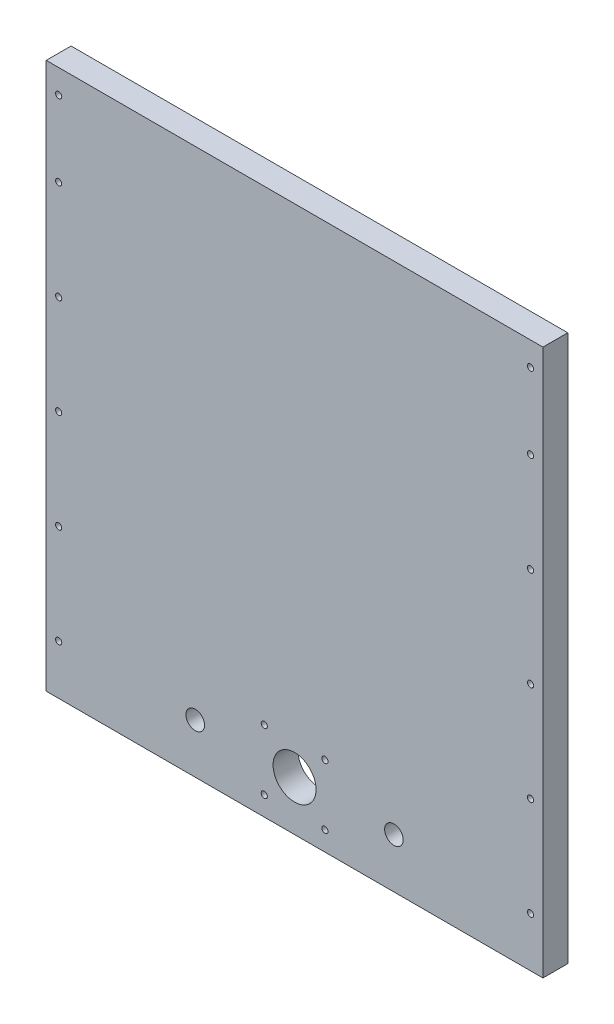
ISO-10303-21;
HEADER;
FILE_DESCRIPTION(('STEP AP214'),'2;1');
FILE_NAME('part.step','',(''),(''),'','','');
FILE_SCHEMA(('AUTOMOTIVE_DESIGN { 1 0 10303 214 1 1 1 1 }'));
ENDSEC;
DATA;
#1=APPLICATION_CONTEXT('core data for automotive mechanical design processes');
#2=APPLICATION_PROTOCOL_DEFINITION('international standard','automotive_design',2000,#1);
#3=PRODUCT_CONTEXT('',#1,'mechanical');
#4=PRODUCT('Part','Part','',(#3));
#5=PRODUCT_RELATED_PRODUCT_CATEGORY('part','',(#4));
#6=PRODUCT_DEFINITION_FORMATION('','',#4);
#7=PRODUCT_DEFINITION_CONTEXT('part definition',#1,'design');
#8=PRODUCT_DEFINITION('design','',#6,#7);
#9=PRODUCT_DEFINITION_SHAPE('','',#8);
#10=(LENGTH_UNIT() NAMED_UNIT(*) SI_UNIT(.MILLI.,.METRE.));
#11=(NAMED_UNIT(*) PLANE_ANGLE_UNIT() SI_UNIT($,.RADIAN.));
#12=(NAMED_UNIT(*) SI_UNIT($,.STERADIAN.) SOLID_ANGLE_UNIT());
#13=UNCERTAINTY_MEASURE_WITH_UNIT(LENGTH_MEASURE(1.E-05),#10,'distance_accuracy_value','');
#14=(GEOMETRIC_REPRESENTATION_CONTEXT(3) GLOBAL_UNCERTAINTY_ASSIGNED_CONTEXT((#13)) GLOBAL_UNIT_ASSIGNED_CONTEXT((#10,
#11,#12)) REPRESENTATION_CONTEXT('',''));
#15=CARTESIAN_POINT('',(0.,0.,0.));
#16=DIRECTION('',(0.,0.,1.));
#17=DIRECTION('',(1.,0.,0.));
#18=AXIS2_PLACEMENT_3D('',#15,#16,#17);
#19=CARTESIAN_POINT('',(0.,279.4,12.7));
#20=DIRECTION('',(0.,0.,-1.));
#21=DIRECTION('',(-1.,0.,0.));
#22=AXIS2_PLACEMENT_3D('',#19,#20,#21);
#23=PLANE('',#22);
#24=CARTESIAN_POINT('',(6.34999999999987,267.208,12.7));
#25=DIRECTION('',(0.,0.,1.));
#26=DIRECTION('',(1.,0.,0.));
#27=AXIS2_PLACEMENT_3D('',#24,#25,#26);
#28=CIRCLE('',#27,1.5875);
#29=CARTESIAN_POINT('',(7.93749999999986,267.208,12.7));
#30=VERTEX_POINT('',#29);
#31=EDGE_CURVE('E209',#30,#30,#28,.T.);
#32=ORIENTED_EDGE('',*,*,#31,.F.);
#33=EDGE_LOOP('',(#32));
#34=FACE_BOUND('',#33,.T.);
#35=CARTESIAN_POINT('',(111.511999988,9.91199998799979,12.7));
#36=DIRECTION('',(0.,0.,1.));
#37=DIRECTION('',(1.,0.,0.));
#38=AXIS2_PLACEMENT_3D('',#35,#36,#37);
#39=CIRCLE('',#38,1.58749999999999);
#40=CARTESIAN_POINT('',(113.099499988,9.91199998799979,12.7));
#41=VERTEX_POINT('',#40);
#42=EDGE_CURVE('E197',#41,#41,#39,.T.);
#43=ORIENTED_EDGE('',*,*,#42,.F.);
#44=EDGE_LOOP('',(#43));
#45=FACE_BOUND('',#44,.T.);
#46=CARTESIAN_POINT('',(111.511999988,40.8999999879998,12.7));
#47=DIRECTION('',(0.,0.,1.));
#48=DIRECTION('',(1.,0.,0.));
#49=AXIS2_PLACEMENT_3D('',#46,#47,#48);
#50=CIRCLE('',#49,1.58749999999999);
#51=CARTESIAN_POINT('',(113.099499988,40.8999999879998,12.7));
#52=VERTEX_POINT('',#51);
#53=EDGE_CURVE('E185',#52,#52,#50,.T.);
#54=ORIENTED_EDGE('',*,*,#53,.F.);
#55=EDGE_LOOP('',(#54));
#56=FACE_BOUND('',#55,.T.);
#57=CARTESIAN_POINT('',(142.499999988,40.899999988,12.7));
#58=DIRECTION('',(0.,0.,1.));
#59=DIRECTION('',(1.,0.,0.));
#60=AXIS2_PLACEMENT_3D('',#57,#58,#59);
#61=CIRCLE('',#60,1.58749999999999);
#62=CARTESIAN_POINT('',(144.087499988,40.899999988,12.7));
#63=VERTEX_POINT('',#62);
#64=EDGE_CURVE('E173',#63,#63,#61,.T.);
#65=ORIENTED_EDGE('',*,*,#64,.F.);
#66=EDGE_LOOP('',(#65));
#67=FACE_BOUND('',#66,.T.);
#68=CARTESIAN_POINT('',(177.8,25.4,12.7));
#69=DIRECTION('',(0.,0.,1.));
#70=DIRECTION('',(1.,0.,0.));
#71=AXIS2_PLACEMENT_3D('',#68,#69,#70);
#72=CIRCLE('',#71,4.76250000000001);
#73=CARTESIAN_POINT('',(182.5625,25.4,12.7));
#74=VERTEX_POINT('',#73);
#75=EDGE_CURVE('E161',#74,#74,#72,.T.);
#76=ORIENTED_EDGE('',*,*,#75,.F.);
#77=EDGE_LOOP('',(#76));
#78=FACE_BOUND('',#77,.T.);
#79=CARTESIAN_POINT('',(6.34999999999947,177.8,12.7));
#80=DIRECTION('',(0.,0.,1.));
#81=DIRECTION('',(1.,0.,0.));
#82=AXIS2_PLACEMENT_3D('',#79,#80,#81);
#83=CIRCLE('',#82,1.5875);
#84=CARTESIAN_POINT('',(7.93749999999947,177.8,12.7));
#85=VERTEX_POINT('',#84);
#86=EDGE_CURVE('E149',#85,#85,#83,.T.);
#87=ORIENTED_EDGE('',*,*,#86,.F.);
#88=EDGE_LOOP('',(#87));
#89=FACE_BOUND('',#88,.T.);
#90=CARTESIAN_POINT('',(6.34999999999965,127.,12.7));
#91=DIRECTION('',(0.,0.,1.));
#92=DIRECTION('',(1.,0.,0.));
#93=AXIS2_PLACEMENT_3D('',#90,#91,#92);
#94=CIRCLE('',#93,1.5875);
#95=CARTESIAN_POINT('',(7.93749999999964,127.,12.7));
#96=VERTEX_POINT('',#95);
#97=EDGE_CURVE('E137',#96,#96,#94,.T.);
#98=ORIENTED_EDGE('',*,*,#97,.F.);
#99=EDGE_LOOP('',(#98));
#100=FACE_BOUND('',#99,.T.);
#101=CARTESIAN_POINT('',(6.34999999999982,76.2,12.7));
#102=DIRECTION('',(0.,0.,1.));
#103=DIRECTION('',(1.,0.,0.));
#104=AXIS2_PLACEMENT_3D('',#101,#102,#103);
#105=CIRCLE('',#104,1.5875);
#106=CARTESIAN_POINT('',(7.93749999999982,76.2,12.7));
#107=VERTEX_POINT('',#106);
#108=EDGE_CURVE('E125',#107,#107,#105,.T.);
#109=ORIENTED_EDGE('',*,*,#108,.F.);
#110=EDGE_LOOP('',(#109));
#111=FACE_BOUND('',#110,.T.);
#112=CARTESIAN_POINT('',(76.2,25.4,12.7));
#113=DIRECTION('',(0.,0.,1.));
#114=DIRECTION('',(1.,0.,0.));
#115=AXIS2_PLACEMENT_3D('',#112,#113,#114);
#116=CIRCLE('',#115,4.7625);
#117=CARTESIAN_POINT('',(80.9625,25.4,12.7));
#118=VERTEX_POINT('',#117);
#119=EDGE_CURVE('E113',#118,#118,#116,.T.);
#120=ORIENTED_EDGE('',*,*,#119,.F.);
#121=EDGE_LOOP('',(#120));
#122=FACE_BOUND('',#121,.T.);
#123=DIRECTION('',(0.,-1.,0.));
#124=VECTOR('',#123,1.);
#125=CARTESIAN_POINT('',(0.,0.,12.7));
#126=LINE('',#125,#124);
#127=CARTESIAN_POINT('',(0.,279.4,12.7));
#128=VERTEX_POINT('',#127);
#129=CARTESIAN_POINT('',(0.,0.,12.7));
#130=VERTEX_POINT('',#129);
#131=EDGE_CURVE('E83',#128,#130,#126,.T.);
#132=ORIENTED_EDGE('',*,*,#131,.T.);
#133=DIRECTION('',(1.,0.,0.));
#134=VECTOR('',#133,1.);
#135=CARTESIAN_POINT('',(0.,0.,12.7));
#136=LINE('',#135,#134);
#137=CARTESIAN_POINT('',(254.,0.,12.7));
#138=VERTEX_POINT('',#137);
#139=EDGE_CURVE('E78',#130,#138,#136,.T.);
#140=ORIENTED_EDGE('',*,*,#139,.T.);
#141=DIRECTION('',(0.,1.,0.));
#142=VECTOR('',#141,1.);
#143=CARTESIAN_POINT('',(254.,0.,12.7));
#144=LINE('',#143,#142);
#145=CARTESIAN_POINT('',(254.,279.4,12.7));
#146=VERTEX_POINT('',#145);
#147=EDGE_CURVE('E81',#138,#146,#144,.T.);
#148=ORIENTED_EDGE('',*,*,#147,.T.);
#149=DIRECTION('',(-1.,0.,0.));
#150=VECTOR('',#149,1.);
#151=CARTESIAN_POINT('',(0.,279.4,12.7));
#152=LINE('',#151,#150);
#153=EDGE_CURVE('E48',#146,#128,#152,.T.);
#154=ORIENTED_EDGE('',*,*,#153,.T.);
#155=EDGE_LOOP('',(#132,#140,#148,#154));
#156=FACE_BOUND('',#155,.T.);
#157=CARTESIAN_POINT('',(6.35,25.4,12.7));
#158=DIRECTION('',(0.,0.,1.));
#159=DIRECTION('',(1.,0.,0.));
#160=AXIS2_PLACEMENT_3D('',#157,#158,#159);
#161=CIRCLE('',#160,1.5875);
#162=CARTESIAN_POINT('',(7.9375,25.4,12.7));
#163=VERTEX_POINT('',#162);
#164=EDGE_CURVE('E98',#163,#163,#161,.T.);
#165=ORIENTED_EDGE('',*,*,#164,.F.);
#166=EDGE_LOOP('',(#165));
#167=FACE_BOUND('',#166,.T.);
#168=CARTESIAN_POINT('',(247.65,25.4,12.7));
#169=DIRECTION('',(0.,0.,1.));
#170=DIRECTION('',(1.,0.,0.));
#171=AXIS2_PLACEMENT_3D('',#168,#169,#170);
#172=CIRCLE('',#171,1.58750000000001);
#173=CARTESIAN_POINT('',(249.2375,25.4,12.7));
#174=VERTEX_POINT('',#173);
#175=EDGE_CURVE('E119',#174,#174,#172,.T.);
#176=ORIENTED_EDGE('',*,*,#175,.F.);
#177=EDGE_LOOP('',(#176));
#178=FACE_BOUND('',#177,.T.);
#179=CARTESIAN_POINT('',(247.65,76.2,12.7));
#180=DIRECTION('',(0.,0.,1.));
#181=DIRECTION('',(1.,0.,0.));
#182=AXIS2_PLACEMENT_3D('',#179,#180,#181);
#183=CIRCLE('',#182,1.58750000000001);
#184=CARTESIAN_POINT('',(249.2375,76.2,12.7));
#185=VERTEX_POINT('',#184);
#186=EDGE_CURVE('E131',#185,#185,#183,.T.);
#187=ORIENTED_EDGE('',*,*,#186,.F.);
#188=EDGE_LOOP('',(#187));
#189=FACE_BOUND('',#188,.T.);
#190=CARTESIAN_POINT('',(247.65,127.,12.7));
#191=DIRECTION('',(0.,0.,1.));
#192=DIRECTION('',(1.,0.,0.));
#193=AXIS2_PLACEMENT_3D('',#190,#191,#192);
#194=CIRCLE('',#193,1.58750000000001);
#195=CARTESIAN_POINT('',(249.2375,127.,12.7));
#196=VERTEX_POINT('',#195);
#197=EDGE_CURVE('E143',#196,#196,#194,.T.);
#198=ORIENTED_EDGE('',*,*,#197,.F.);
#199=EDGE_LOOP('',(#198));
#200=FACE_BOUND('',#199,.T.);
#201=CARTESIAN_POINT('',(247.649999999999,177.8,12.7));
#202=DIRECTION('',(0.,0.,1.));
#203=DIRECTION('',(1.,0.,0.));
#204=AXIS2_PLACEMENT_3D('',#201,#202,#203);
#205=CIRCLE('',#204,1.58750000000001);
#206=CARTESIAN_POINT('',(249.237499999999,177.8,12.7));
#207=VERTEX_POINT('',#206);
#208=EDGE_CURVE('E155',#207,#207,#205,.T.);
#209=ORIENTED_EDGE('',*,*,#208,.F.);
#210=EDGE_LOOP('',(#209));
#211=FACE_BOUND('',#210,.T.);
#212=CARTESIAN_POINT('',(127.,25.4,12.7));
#213=DIRECTION('',(0.,0.,1.));
#214=DIRECTION('',(1.,0.,0.));
#215=AXIS2_PLACEMENT_3D('',#212,#213,#214);
#216=CIRCLE('',#215,11.);
#217=CARTESIAN_POINT('',(138.,25.4,12.7));
#218=VERTEX_POINT('',#217);
#219=EDGE_CURVE('E167',#218,#218,#216,.T.);
#220=ORIENTED_EDGE('',*,*,#219,.F.);
#221=EDGE_LOOP('',(#220));
#222=FACE_BOUND('',#221,.T.);
#223=CARTESIAN_POINT('',(6.35,228.6,12.7));
#224=DIRECTION('',(0.,0.,1.));
#225=DIRECTION('',(1.,0.,0.));
#226=AXIS2_PLACEMENT_3D('',#223,#224,#225);
#227=CIRCLE('',#226,1.5875);
#228=CARTESIAN_POINT('',(7.9375,228.6,12.7));
#229=VERTEX_POINT('',#228);
#230=EDGE_CURVE('E179',#229,#229,#227,.T.);
#231=ORIENTED_EDGE('',*,*,#230,.F.);
#232=EDGE_LOOP('',(#231));
#233=FACE_BOUND('',#232,.T.);
#234=CARTESIAN_POINT('',(142.499999988,9.911999988,12.7));
#235=DIRECTION('',(0.,0.,1.));
#236=DIRECTION('',(1.,0.,0.));
#237=AXIS2_PLACEMENT_3D('',#234,#235,#236);
#238=CIRCLE('',#237,1.58749999999999);
#239=CARTESIAN_POINT('',(144.087499988,9.911999988,12.7));
#240=VERTEX_POINT('',#239);
#241=EDGE_CURVE('E191',#240,#240,#238,.T.);
#242=ORIENTED_EDGE('',*,*,#241,.F.);
#243=EDGE_LOOP('',(#242));
#244=FACE_BOUND('',#243,.T.);
#245=CARTESIAN_POINT('',(247.65,228.6,12.7));
#246=DIRECTION('',(0.,0.,1.));
#247=DIRECTION('',(1.,0.,0.));
#248=AXIS2_PLACEMENT_3D('',#245,#246,#247);
#249=CIRCLE('',#248,1.58750000000001);
#250=CARTESIAN_POINT('',(249.2375,228.6,12.7));
#251=VERTEX_POINT('',#250);
#252=EDGE_CURVE('E203',#251,#251,#249,.T.);
#253=ORIENTED_EDGE('',*,*,#252,.F.);
#254=EDGE_LOOP('',(#253));
#255=FACE_BOUND('',#254,.T.);
#256=CARTESIAN_POINT('',(247.65,267.208,12.7));
#257=DIRECTION('',(0.,0.,1.));
#258=DIRECTION('',(1.,0.,0.));
#259=AXIS2_PLACEMENT_3D('',#256,#257,#258);
#260=CIRCLE('',#259,1.58750000000001);
#261=CARTESIAN_POINT('',(249.2375,267.208,12.7));
#262=VERTEX_POINT('',#261);
#263=EDGE_CURVE('E215',#262,#262,#260,.T.);
#264=ORIENTED_EDGE('',*,*,#263,.F.);
#265=EDGE_LOOP('',(#264));
#266=FACE_BOUND('',#265,.T.);
#267=ADVANCED_FACE('F31',(#34,#45,#56,#67,#78,#89,#100,#111,#122,#156,#167,#178,#189,#200,#211,
#222,#233,#244,#255,#266),#23,.F.);
#268=CARTESIAN_POINT('',(0.,279.4,0.));
#269=DIRECTION('',(0.,0.,-1.));
#270=DIRECTION('',(-1.,0.,0.));
#271=AXIS2_PLACEMENT_3D('',#268,#269,#270);
#272=PLANE('',#271);
#273=CARTESIAN_POINT('',(6.34999999999987,267.208,0.));
#274=DIRECTION('',(0.,0.,1.));
#275=DIRECTION('',(1.,0.,0.));
#276=AXIS2_PLACEMENT_3D('',#273,#274,#275);
#277=CIRCLE('',#276,1.5875);
#278=CARTESIAN_POINT('',(7.93749999999986,267.208,0.));
#279=VERTEX_POINT('',#278);
#280=EDGE_CURVE('E212',#279,#279,#277,.T.);
#281=ORIENTED_EDGE('',*,*,#280,.T.);
#282=EDGE_LOOP('',(#281));
#283=FACE_BOUND('',#282,.T.);
#284=CARTESIAN_POINT('',(111.511999988,9.91199998799979,0.));
#285=DIRECTION('',(0.,0.,1.));
#286=DIRECTION('',(1.,0.,0.));
#287=AXIS2_PLACEMENT_3D('',#284,#285,#286);
#288=CIRCLE('',#287,1.58749999999999);
#289=CARTESIAN_POINT('',(113.099499988,9.91199998799979,0.));
#290=VERTEX_POINT('',#289);
#291=EDGE_CURVE('E200',#290,#290,#288,.T.);
#292=ORIENTED_EDGE('',*,*,#291,.T.);
#293=EDGE_LOOP('',(#292));
#294=FACE_BOUND('',#293,.T.);
#295=CARTESIAN_POINT('',(111.511999988,40.8999999879998,0.));
#296=DIRECTION('',(0.,0.,1.));
#297=DIRECTION('',(1.,0.,0.));
#298=AXIS2_PLACEMENT_3D('',#295,#296,#297);
#299=CIRCLE('',#298,1.58749999999999);
#300=CARTESIAN_POINT('',(113.099499988,40.8999999879998,0.));
#301=VERTEX_POINT('',#300);
#302=EDGE_CURVE('E188',#301,#301,#299,.T.);
#303=ORIENTED_EDGE('',*,*,#302,.T.);
#304=EDGE_LOOP('',(#303));
#305=FACE_BOUND('',#304,.T.);
#306=CARTESIAN_POINT('',(142.499999988,40.899999988,0.));
#307=DIRECTION('',(0.,0.,1.));
#308=DIRECTION('',(1.,0.,0.));
#309=AXIS2_PLACEMENT_3D('',#306,#307,#308);
#310=CIRCLE('',#309,1.58749999999999);
#311=CARTESIAN_POINT('',(144.087499988,40.899999988,0.));
#312=VERTEX_POINT('',#311);
#313=EDGE_CURVE('E176',#312,#312,#310,.T.);
#314=ORIENTED_EDGE('',*,*,#313,.T.);
#315=EDGE_LOOP('',(#314));
#316=FACE_BOUND('',#315,.T.);
#317=CARTESIAN_POINT('',(177.8,25.4,0.));
#318=DIRECTION('',(0.,0.,1.));
#319=DIRECTION('',(1.,0.,0.));
#320=AXIS2_PLACEMENT_3D('',#317,#318,#319);
#321=CIRCLE('',#320,4.76250000000001);
#322=CARTESIAN_POINT('',(182.5625,25.4,0.));
#323=VERTEX_POINT('',#322);
#324=EDGE_CURVE('E164',#323,#323,#321,.T.);
#325=ORIENTED_EDGE('',*,*,#324,.T.);
#326=EDGE_LOOP('',(#325));
#327=FACE_BOUND('',#326,.T.);
#328=CARTESIAN_POINT('',(6.34999999999947,177.8,0.));
#329=DIRECTION('',(0.,0.,1.));
#330=DIRECTION('',(1.,0.,0.));
#331=AXIS2_PLACEMENT_3D('',#328,#329,#330);
#332=CIRCLE('',#331,1.5875);
#333=CARTESIAN_POINT('',(7.93749999999947,177.8,0.));
#334=VERTEX_POINT('',#333);
#335=EDGE_CURVE('E152',#334,#334,#332,.T.);
#336=ORIENTED_EDGE('',*,*,#335,.T.);
#337=EDGE_LOOP('',(#336));
#338=FACE_BOUND('',#337,.T.);
#339=CARTESIAN_POINT('',(6.34999999999965,127.,0.));
#340=DIRECTION('',(0.,0.,1.));
#341=DIRECTION('',(1.,0.,0.));
#342=AXIS2_PLACEMENT_3D('',#339,#340,#341);
#343=CIRCLE('',#342,1.5875);
#344=CARTESIAN_POINT('',(7.93749999999964,127.,0.));
#345=VERTEX_POINT('',#344);
#346=EDGE_CURVE('E140',#345,#345,#343,.T.);
#347=ORIENTED_EDGE('',*,*,#346,.T.);
#348=EDGE_LOOP('',(#347));
#349=FACE_BOUND('',#348,.T.);
#350=CARTESIAN_POINT('',(6.34999999999982,76.2,0.));
#351=DIRECTION('',(0.,0.,1.));
#352=DIRECTION('',(1.,0.,0.));
#353=AXIS2_PLACEMENT_3D('',#350,#351,#352);
#354=CIRCLE('',#353,1.5875);
#355=CARTESIAN_POINT('',(7.93749999999982,76.2,0.));
#356=VERTEX_POINT('',#355);
#357=EDGE_CURVE('E128',#356,#356,#354,.T.);
#358=ORIENTED_EDGE('',*,*,#357,.T.);
#359=EDGE_LOOP('',(#358));
#360=FACE_BOUND('',#359,.T.);
#361=CARTESIAN_POINT('',(76.2,25.4,0.));
#362=DIRECTION('',(0.,0.,1.));
#363=DIRECTION('',(1.,0.,0.));
#364=AXIS2_PLACEMENT_3D('',#361,#362,#363);
#365=CIRCLE('',#364,4.7625);
#366=CARTESIAN_POINT('',(80.9625,25.4,0.));
#367=VERTEX_POINT('',#366);
#368=EDGE_CURVE('E116',#367,#367,#365,.T.);
#369=ORIENTED_EDGE('',*,*,#368,.T.);
#370=EDGE_LOOP('',(#369));
#371=FACE_BOUND('',#370,.T.);
#372=DIRECTION('',(0.,-1.,0.));
#373=VECTOR('',#372,1.);
#374=CARTESIAN_POINT('',(0.,0.,0.));
#375=LINE('',#374,#373);
#376=CARTESIAN_POINT('',(0.,279.4,0.));
#377=VERTEX_POINT('',#376);
#378=CARTESIAN_POINT('',(0.,0.,0.));
#379=VERTEX_POINT('',#378);
#380=EDGE_CURVE('E95',#377,#379,#375,.T.);
#381=ORIENTED_EDGE('',*,*,#380,.F.);
#382=DIRECTION('',(-1.,0.,0.));
#383=VECTOR('',#382,1.);
#384=CARTESIAN_POINT('',(0.,279.4,0.));
#385=LINE('',#384,#383);
#386=CARTESIAN_POINT('',(254.,279.4,0.));
#387=VERTEX_POINT('',#386);
#388=EDGE_CURVE('E71',#387,#377,#385,.T.);
#389=ORIENTED_EDGE('',*,*,#388,.F.);
#390=DIRECTION('',(0.,1.,0.));
#391=VECTOR('',#390,1.);
#392=CARTESIAN_POINT('',(254.,0.,0.));
#393=LINE('',#392,#391);
#394=CARTESIAN_POINT('',(254.,0.,0.));
#395=VERTEX_POINT('',#394);
#396=EDGE_CURVE('E65',#395,#387,#393,.T.);
#397=ORIENTED_EDGE('',*,*,#396,.F.);
#398=DIRECTION('',(1.,0.,0.));
#399=VECTOR('',#398,1.);
#400=CARTESIAN_POINT('',(0.,0.,0.));
#401=LINE('',#400,#399);
#402=EDGE_CURVE('E87',#379,#395,#401,.T.);
#403=ORIENTED_EDGE('',*,*,#402,.F.);
#404=EDGE_LOOP('',(#381,#389,#397,#403));
#405=FACE_BOUND('',#404,.T.);
#406=CARTESIAN_POINT('',(6.35,25.4,0.));
#407=DIRECTION('',(0.,0.,1.));
#408=DIRECTION('',(1.,0.,0.));
#409=AXIS2_PLACEMENT_3D('',#406,#407,#408);
#410=CIRCLE('',#409,1.5875);
#411=CARTESIAN_POINT('',(7.9375,25.4,0.));
#412=VERTEX_POINT('',#411);
#413=EDGE_CURVE('E110',#412,#412,#410,.T.);
#414=ORIENTED_EDGE('',*,*,#413,.T.);
#415=EDGE_LOOP('',(#414));
#416=FACE_BOUND('',#415,.T.);
#417=CARTESIAN_POINT('',(247.65,25.4,0.));
#418=DIRECTION('',(0.,0.,1.));
#419=DIRECTION('',(1.,0.,0.));
#420=AXIS2_PLACEMENT_3D('',#417,#418,#419);
#421=CIRCLE('',#420,1.58750000000001);
#422=CARTESIAN_POINT('',(249.2375,25.4,0.));
#423=VERTEX_POINT('',#422);
#424=EDGE_CURVE('E122',#423,#423,#421,.T.);
#425=ORIENTED_EDGE('',*,*,#424,.T.);
#426=EDGE_LOOP('',(#425));
#427=FACE_BOUND('',#426,.T.);
#428=CARTESIAN_POINT('',(247.65,76.2,0.));
#429=DIRECTION('',(0.,0.,1.));
#430=DIRECTION('',(1.,0.,0.));
#431=AXIS2_PLACEMENT_3D('',#428,#429,#430);
#432=CIRCLE('',#431,1.58750000000001);
#433=CARTESIAN_POINT('',(249.2375,76.2,0.));
#434=VERTEX_POINT('',#433);
#435=EDGE_CURVE('E134',#434,#434,#432,.T.);
#436=ORIENTED_EDGE('',*,*,#435,.T.);
#437=EDGE_LOOP('',(#436));
#438=FACE_BOUND('',#437,.T.);
#439=CARTESIAN_POINT('',(247.65,127.,0.));
#440=DIRECTION('',(0.,0.,1.));
#441=DIRECTION('',(1.,0.,0.));
#442=AXIS2_PLACEMENT_3D('',#439,#440,#441);
#443=CIRCLE('',#442,1.58750000000001);
#444=CARTESIAN_POINT('',(249.2375,127.,0.));
#445=VERTEX_POINT('',#444);
#446=EDGE_CURVE('E146',#445,#445,#443,.T.);
#447=ORIENTED_EDGE('',*,*,#446,.T.);
#448=EDGE_LOOP('',(#447));
#449=FACE_BOUND('',#448,.T.);
#450=CARTESIAN_POINT('',(247.649999999999,177.8,0.));
#451=DIRECTION('',(0.,0.,1.));
#452=DIRECTION('',(1.,0.,0.));
#453=AXIS2_PLACEMENT_3D('',#450,#451,#452);
#454=CIRCLE('',#453,1.58750000000001);
#455=CARTESIAN_POINT('',(249.237499999999,177.8,0.));
#456=VERTEX_POINT('',#455);
#457=EDGE_CURVE('E158',#456,#456,#454,.T.);
#458=ORIENTED_EDGE('',*,*,#457,.T.);
#459=EDGE_LOOP('',(#458));
#460=FACE_BOUND('',#459,.T.);
#461=CARTESIAN_POINT('',(127.,25.4,0.));
#462=DIRECTION('',(0.,0.,1.));
#463=DIRECTION('',(1.,0.,0.));
#464=AXIS2_PLACEMENT_3D('',#461,#462,#463);
#465=CIRCLE('',#464,11.);
#466=CARTESIAN_POINT('',(138.,25.4,0.));
#467=VERTEX_POINT('',#466);
#468=EDGE_CURVE('E170',#467,#467,#465,.T.);
#469=ORIENTED_EDGE('',*,*,#468,.T.);
#470=EDGE_LOOP('',(#469));
#471=FACE_BOUND('',#470,.T.);
#472=CARTESIAN_POINT('',(6.35,228.6,0.));
#473=DIRECTION('',(0.,0.,1.));
#474=DIRECTION('',(1.,0.,0.));
#475=AXIS2_PLACEMENT_3D('',#472,#473,#474);
#476=CIRCLE('',#475,1.5875);
#477=CARTESIAN_POINT('',(7.9375,228.6,0.));
#478=VERTEX_POINT('',#477);
#479=EDGE_CURVE('E182',#478,#478,#476,.T.);
#480=ORIENTED_EDGE('',*,*,#479,.T.);
#481=EDGE_LOOP('',(#480));
#482=FACE_BOUND('',#481,.T.);
#483=CARTESIAN_POINT('',(142.499999988,9.911999988,0.));
#484=DIRECTION('',(0.,0.,1.));
#485=DIRECTION('',(1.,0.,0.));
#486=AXIS2_PLACEMENT_3D('',#483,#484,#485);
#487=CIRCLE('',#486,1.58749999999999);
#488=CARTESIAN_POINT('',(144.087499988,9.911999988,0.));
#489=VERTEX_POINT('',#488);
#490=EDGE_CURVE('E194',#489,#489,#487,.T.);
#491=ORIENTED_EDGE('',*,*,#490,.T.);
#492=EDGE_LOOP('',(#491));
#493=FACE_BOUND('',#492,.T.);
#494=CARTESIAN_POINT('',(247.65,228.6,0.));
#495=DIRECTION('',(0.,0.,1.));
#496=DIRECTION('',(1.,0.,0.));
#497=AXIS2_PLACEMENT_3D('',#494,#495,#496);
#498=CIRCLE('',#497,1.58750000000001);
#499=CARTESIAN_POINT('',(249.2375,228.6,0.));
#500=VERTEX_POINT('',#499);
#501=EDGE_CURVE('E206',#500,#500,#498,.T.);
#502=ORIENTED_EDGE('',*,*,#501,.T.);
#503=EDGE_LOOP('',(#502));
#504=FACE_BOUND('',#503,.T.);
#505=CARTESIAN_POINT('',(247.65,267.208,0.));
#506=DIRECTION('',(0.,0.,1.));
#507=DIRECTION('',(1.,0.,0.));
#508=AXIS2_PLACEMENT_3D('',#505,#506,#507);
#509=CIRCLE('',#508,1.58750000000001);
#510=CARTESIAN_POINT('',(249.2375,267.208,0.));
#511=VERTEX_POINT('',#510);
#512=EDGE_CURVE('E218',#511,#511,#509,.T.);
#513=ORIENTED_EDGE('',*,*,#512,.T.);
#514=EDGE_LOOP('',(#513));
#515=FACE_BOUND('',#514,.T.);
#516=ADVANCED_FACE('F106',(#283,#294,#305,#316,#327,#338,#349,#360,#371,#405,#416,#427,#438,
#449,#460,#471,#482,#493,#504,#515),#272,.T.);
#517=CARTESIAN_POINT('',(0.,0.,12.7));
#518=DIRECTION('',(1.,0.,0.));
#519=DIRECTION('',(0.,0.,-1.));
#520=AXIS2_PLACEMENT_3D('',#517,#518,#519);
#521=PLANE('',#520);
#522=ORIENTED_EDGE('',*,*,#380,.T.);
#523=DIRECTION('',(0.,0.,-1.));
#524=VECTOR('',#523,1.);
#525=CARTESIAN_POINT('',(0.,0.,12.7));
#526=LINE('',#525,#524);
#527=EDGE_CURVE('E11',#130,#379,#526,.T.);
#528=ORIENTED_EDGE('',*,*,#527,.F.);
#529=ORIENTED_EDGE('',*,*,#131,.F.);
#530=DIRECTION('',(0.,0.,-1.));
#531=VECTOR('',#530,1.);
#532=CARTESIAN_POINT('',(0.,279.4,12.7));
#533=LINE('',#532,#531);
#534=EDGE_CURVE('E91',#128,#377,#533,.T.);
#535=ORIENTED_EDGE('',*,*,#534,.T.);
#536=EDGE_LOOP('',(#522,#528,#529,#535));
#537=FACE_BOUND('',#536,.T.);
#538=ADVANCED_FACE('F33',(#537),#521,.F.);
#539=CARTESIAN_POINT('',(0.,0.,12.7));
#540=DIRECTION('',(0.,1.,0.));
#541=DIRECTION('',(0.,0.,1.));
#542=AXIS2_PLACEMENT_3D('',#539,#540,#541);
#543=PLANE('',#542);
#544=ORIENTED_EDGE('',*,*,#402,.T.);
#545=DIRECTION('',(0.,0.,-1.));
#546=VECTOR('',#545,1.);
#547=CARTESIAN_POINT('',(254.,0.,12.7));
#548=LINE('',#547,#546);
#549=EDGE_CURVE('E40',#138,#395,#548,.T.);
#550=ORIENTED_EDGE('',*,*,#549,.F.);
#551=ORIENTED_EDGE('',*,*,#139,.F.);
#552=ORIENTED_EDGE('',*,*,#527,.T.);
#553=EDGE_LOOP('',(#544,#550,#551,#552));
#554=FACE_BOUND('',#553,.T.);
#555=ADVANCED_FACE('F86',(#554),#543,.F.);
#556=CARTESIAN_POINT('',(254.,0.,12.7));
#557=DIRECTION('',(-1.,0.,0.));
#558=DIRECTION('',(0.,0.,1.));
#559=AXIS2_PLACEMENT_3D('',#556,#557,#558);
#560=PLANE('',#559);
#561=ORIENTED_EDGE('',*,*,#396,.T.);
#562=DIRECTION('',(0.,0.,-1.));
#563=VECTOR('',#562,1.);
#564=CARTESIAN_POINT('',(254.,279.4,12.7));
#565=LINE('',#564,#563);
#566=EDGE_CURVE('E88',#146,#387,#565,.T.);
#567=ORIENTED_EDGE('',*,*,#566,.F.);
#568=ORIENTED_EDGE('',*,*,#147,.F.);
#569=ORIENTED_EDGE('',*,*,#549,.T.);
#570=EDGE_LOOP('',(#561,#567,#568,#569));
#571=FACE_BOUND('',#570,.T.);
#572=ADVANCED_FACE('F89',(#571),#560,.F.);
#573=CARTESIAN_POINT('',(0.,279.4,12.7));
#574=DIRECTION('',(0.,-1.,0.));
#575=DIRECTION('',(0.,0.,-1.));
#576=AXIS2_PLACEMENT_3D('',#573,#574,#575);
#577=PLANE('',#576);
#578=ORIENTED_EDGE('',*,*,#388,.T.);
#579=ORIENTED_EDGE('',*,*,#534,.F.);
#580=ORIENTED_EDGE('',*,*,#153,.F.);
#581=ORIENTED_EDGE('',*,*,#566,.T.);
#582=EDGE_LOOP('',(#578,#579,#580,#581));
#583=FACE_BOUND('',#582,.T.);
#584=ADVANCED_FACE('F103',(#583),#577,.F.);
#585=CARTESIAN_POINT('',(6.35,25.4,12.7));
#586=DIRECTION('',(0.,0.,-1.));
#587=DIRECTION('',(-1.,0.,0.));
#588=AXIS2_PLACEMENT_3D('',#585,#586,#587);
#589=CYLINDRICAL_SURFACE('',#588,1.5875);
#590=ORIENTED_EDGE('',*,*,#164,.T.);
#591=EDGE_LOOP('',(#590));
#592=FACE_BOUND('',#591,.T.);
#593=ORIENTED_EDGE('',*,*,#413,.F.);
#594=EDGE_LOOP('',(#593));
#595=FACE_BOUND('',#594,.T.);
#596=ADVANCED_FACE('F238',(#592,#595),#589,.F.);
#597=CARTESIAN_POINT('',(76.2,25.4,12.7));
#598=DIRECTION('',(0.,0.,-1.));
#599=DIRECTION('',(-1.,0.,0.));
#600=AXIS2_PLACEMENT_3D('',#597,#598,#599);
#601=CYLINDRICAL_SURFACE('',#600,4.7625);
#602=ORIENTED_EDGE('',*,*,#119,.T.);
#603=EDGE_LOOP('',(#602));
#604=FACE_BOUND('',#603,.T.);
#605=ORIENTED_EDGE('',*,*,#368,.F.);
#606=EDGE_LOOP('',(#605));
#607=FACE_BOUND('',#606,.T.);
#608=ADVANCED_FACE('F284',(#604,#607),#601,.F.);
#609=CARTESIAN_POINT('',(247.65,25.4,12.7));
#610=DIRECTION('',(0.,0.,-1.));
#611=DIRECTION('',(-1.,0.,0.));
#612=AXIS2_PLACEMENT_3D('',#609,#610,#611);
#613=CYLINDRICAL_SURFACE('',#612,1.58750000000001);
#614=ORIENTED_EDGE('',*,*,#175,.T.);
#615=EDGE_LOOP('',(#614));
#616=FACE_BOUND('',#615,.T.);
#617=ORIENTED_EDGE('',*,*,#424,.F.);
#618=EDGE_LOOP('',(#617));
#619=FACE_BOUND('',#618,.T.);
#620=ADVANCED_FACE('F292',(#616,#619),#613,.F.);
#621=CARTESIAN_POINT('',(6.34999999999982,76.2,12.7));
#622=DIRECTION('',(0.,0.,-1.));
#623=DIRECTION('',(-1.,0.,0.));
#624=AXIS2_PLACEMENT_3D('',#621,#622,#623);
#625=CYLINDRICAL_SURFACE('',#624,1.5875);
#626=ORIENTED_EDGE('',*,*,#108,.T.);
#627=EDGE_LOOP('',(#626));
#628=FACE_BOUND('',#627,.T.);
#629=ORIENTED_EDGE('',*,*,#357,.F.);
#630=EDGE_LOOP('',(#629));
#631=FACE_BOUND('',#630,.T.);
#632=ADVANCED_FACE('F300',(#628,#631),#625,.F.);
#633=CARTESIAN_POINT('',(247.65,76.2,12.7));
#634=DIRECTION('',(0.,0.,-1.));
#635=DIRECTION('',(-1.,0.,0.));
#636=AXIS2_PLACEMENT_3D('',#633,#634,#635);
#637=CYLINDRICAL_SURFACE('',#636,1.58750000000001);
#638=ORIENTED_EDGE('',*,*,#186,.T.);
#639=EDGE_LOOP('',(#638));
#640=FACE_BOUND('',#639,.T.);
#641=ORIENTED_EDGE('',*,*,#435,.F.);
#642=EDGE_LOOP('',(#641));
#643=FACE_BOUND('',#642,.T.);
#644=ADVANCED_FACE('F309',(#640,#643),#637,.F.);
#645=CARTESIAN_POINT('',(6.34999999999965,127.,12.7));
#646=DIRECTION('',(0.,0.,-1.));
#647=DIRECTION('',(-1.,0.,0.));
#648=AXIS2_PLACEMENT_3D('',#645,#646,#647);
#649=CYLINDRICAL_SURFACE('',#648,1.5875);
#650=ORIENTED_EDGE('',*,*,#97,.T.);
#651=EDGE_LOOP('',(#650));
#652=FACE_BOUND('',#651,.T.);
#653=ORIENTED_EDGE('',*,*,#346,.F.);
#654=EDGE_LOOP('',(#653));
#655=FACE_BOUND('',#654,.T.);
#656=ADVANCED_FACE('F318',(#652,#655),#649,.F.);
#657=CARTESIAN_POINT('',(247.65,127.,12.7));
#658=DIRECTION('',(0.,0.,-1.));
#659=DIRECTION('',(-1.,0.,0.));
#660=AXIS2_PLACEMENT_3D('',#657,#658,#659);
#661=CYLINDRICAL_SURFACE('',#660,1.58750000000001);
#662=ORIENTED_EDGE('',*,*,#197,.T.);
#663=EDGE_LOOP('',(#662));
#664=FACE_BOUND('',#663,.T.);
#665=ORIENTED_EDGE('',*,*,#446,.F.);
#666=EDGE_LOOP('',(#665));
#667=FACE_BOUND('',#666,.T.);
#668=ADVANCED_FACE('F327',(#664,#667),#661,.F.);
#669=CARTESIAN_POINT('',(6.34999999999947,177.8,12.7));
#670=DIRECTION('',(0.,0.,-1.));
#671=DIRECTION('',(-1.,0.,0.));
#672=AXIS2_PLACEMENT_3D('',#669,#670,#671);
#673=CYLINDRICAL_SURFACE('',#672,1.5875);
#674=ORIENTED_EDGE('',*,*,#86,.T.);
#675=EDGE_LOOP('',(#674));
#676=FACE_BOUND('',#675,.T.);
#677=ORIENTED_EDGE('',*,*,#335,.F.);
#678=EDGE_LOOP('',(#677));
#679=FACE_BOUND('',#678,.T.);
#680=ADVANCED_FACE('F336',(#676,#679),#673,.F.);
#681=CARTESIAN_POINT('',(247.649999999999,177.8,12.7));
#682=DIRECTION('',(0.,0.,-1.));
#683=DIRECTION('',(-1.,0.,0.));
#684=AXIS2_PLACEMENT_3D('',#681,#682,#683);
#685=CYLINDRICAL_SURFACE('',#684,1.58750000000001);
#686=ORIENTED_EDGE('',*,*,#208,.T.);
#687=EDGE_LOOP('',(#686));
#688=FACE_BOUND('',#687,.T.);
#689=ORIENTED_EDGE('',*,*,#457,.F.);
#690=EDGE_LOOP('',(#689));
#691=FACE_BOUND('',#690,.T.);
#692=ADVANCED_FACE('F345',(#688,#691),#685,.F.);
#693=CARTESIAN_POINT('',(177.8,25.4,12.7));
#694=DIRECTION('',(0.,0.,-1.));
#695=DIRECTION('',(-1.,0.,0.));
#696=AXIS2_PLACEMENT_3D('',#693,#694,#695);
#697=CYLINDRICAL_SURFACE('',#696,4.76250000000001);
#698=ORIENTED_EDGE('',*,*,#75,.T.);
#699=EDGE_LOOP('',(#698));
#700=FACE_BOUND('',#699,.T.);
#701=ORIENTED_EDGE('',*,*,#324,.F.);
#702=EDGE_LOOP('',(#701));
#703=FACE_BOUND('',#702,.T.);
#704=ADVANCED_FACE('F354',(#700,#703),#697,.F.);
#705=CARTESIAN_POINT('',(127.,25.4,12.7));
#706=DIRECTION('',(0.,0.,-1.));
#707=DIRECTION('',(-1.,0.,0.));
#708=AXIS2_PLACEMENT_3D('',#705,#706,#707);
#709=CYLINDRICAL_SURFACE('',#708,11.);
#710=ORIENTED_EDGE('',*,*,#219,.T.);
#711=EDGE_LOOP('',(#710));
#712=FACE_BOUND('',#711,.T.);
#713=ORIENTED_EDGE('',*,*,#468,.F.);
#714=EDGE_LOOP('',(#713));
#715=FACE_BOUND('',#714,.T.);
#716=ADVANCED_FACE('F363',(#712,#715),#709,.F.);
#717=CARTESIAN_POINT('',(142.499999988,40.899999988,12.7));
#718=DIRECTION('',(0.,0.,-1.));
#719=DIRECTION('',(-1.,0.,0.));
#720=AXIS2_PLACEMENT_3D('',#717,#718,#719);
#721=CYLINDRICAL_SURFACE('',#720,1.58749999999999);
#722=ORIENTED_EDGE('',*,*,#64,.T.);
#723=EDGE_LOOP('',(#722));
#724=FACE_BOUND('',#723,.T.);
#725=ORIENTED_EDGE('',*,*,#313,.F.);
#726=EDGE_LOOP('',(#725));
#727=FACE_BOUND('',#726,.T.);
#728=ADVANCED_FACE('F372',(#724,#727),#721,.F.);
#729=CARTESIAN_POINT('',(6.35,228.6,12.7));
#730=DIRECTION('',(0.,0.,-1.));
#731=DIRECTION('',(-1.,0.,0.));
#732=AXIS2_PLACEMENT_3D('',#729,#730,#731);
#733=CYLINDRICAL_SURFACE('',#732,1.5875);
#734=ORIENTED_EDGE('',*,*,#230,.T.);
#735=EDGE_LOOP('',(#734));
#736=FACE_BOUND('',#735,.T.);
#737=ORIENTED_EDGE('',*,*,#479,.F.);
#738=EDGE_LOOP('',(#737));
#739=FACE_BOUND('',#738,.T.);
#740=ADVANCED_FACE('F381',(#736,#739),#733,.F.);
#741=CARTESIAN_POINT('',(111.511999988,40.8999999879998,12.7));
#742=DIRECTION('',(0.,0.,-1.));
#743=DIRECTION('',(-1.,0.,0.));
#744=AXIS2_PLACEMENT_3D('',#741,#742,#743);
#745=CYLINDRICAL_SURFACE('',#744,1.58749999999999);
#746=ORIENTED_EDGE('',*,*,#53,.T.);
#747=EDGE_LOOP('',(#746));
#748=FACE_BOUND('',#747,.T.);
#749=ORIENTED_EDGE('',*,*,#302,.F.);
#750=EDGE_LOOP('',(#749));
#751=FACE_BOUND('',#750,.T.);
#752=ADVANCED_FACE('F390',(#748,#751),#745,.F.);
#753=CARTESIAN_POINT('',(142.499999988,9.911999988,12.7));
#754=DIRECTION('',(0.,0.,-1.));
#755=DIRECTION('',(-1.,0.,0.));
#756=AXIS2_PLACEMENT_3D('',#753,#754,#755);
#757=CYLINDRICAL_SURFACE('',#756,1.58749999999999);
#758=ORIENTED_EDGE('',*,*,#241,.T.);
#759=EDGE_LOOP('',(#758));
#760=FACE_BOUND('',#759,.T.);
#761=ORIENTED_EDGE('',*,*,#490,.F.);
#762=EDGE_LOOP('',(#761));
#763=FACE_BOUND('',#762,.T.);
#764=ADVANCED_FACE('F399',(#760,#763),#757,.F.);
#765=CARTESIAN_POINT('',(111.511999988,9.91199998799979,12.7));
#766=DIRECTION('',(0.,0.,-1.));
#767=DIRECTION('',(-1.,0.,0.));
#768=AXIS2_PLACEMENT_3D('',#765,#766,#767);
#769=CYLINDRICAL_SURFACE('',#768,1.58749999999999);
#770=ORIENTED_EDGE('',*,*,#42,.T.);
#771=EDGE_LOOP('',(#770));
#772=FACE_BOUND('',#771,.T.);
#773=ORIENTED_EDGE('',*,*,#291,.F.);
#774=EDGE_LOOP('',(#773));
#775=FACE_BOUND('',#774,.T.);
#776=ADVANCED_FACE('F408',(#772,#775),#769,.F.);
#777=CARTESIAN_POINT('',(247.65,228.6,12.7));
#778=DIRECTION('',(0.,0.,-1.));
#779=DIRECTION('',(-1.,0.,0.));
#780=AXIS2_PLACEMENT_3D('',#777,#778,#779);
#781=CYLINDRICAL_SURFACE('',#780,1.58750000000001);
#782=ORIENTED_EDGE('',*,*,#252,.T.);
#783=EDGE_LOOP('',(#782));
#784=FACE_BOUND('',#783,.T.);
#785=ORIENTED_EDGE('',*,*,#501,.F.);
#786=EDGE_LOOP('',(#785));
#787=FACE_BOUND('',#786,.T.);
#788=ADVANCED_FACE('F417',(#784,#787),#781,.F.);
#789=CARTESIAN_POINT('',(6.34999999999987,267.208,12.7));
#790=DIRECTION('',(0.,0.,-1.));
#791=DIRECTION('',(-1.,0.,0.));
#792=AXIS2_PLACEMENT_3D('',#789,#790,#791);
#793=CYLINDRICAL_SURFACE('',#792,1.5875);
#794=ORIENTED_EDGE('',*,*,#31,.T.);
#795=EDGE_LOOP('',(#794));
#796=FACE_BOUND('',#795,.T.);
#797=ORIENTED_EDGE('',*,*,#280,.F.);
#798=EDGE_LOOP('',(#797));
#799=FACE_BOUND('',#798,.T.);
#800=ADVANCED_FACE('F426',(#796,#799),#793,.F.);
#801=CARTESIAN_POINT('',(247.65,267.208,12.7));
#802=DIRECTION('',(0.,0.,-1.));
#803=DIRECTION('',(-1.,0.,0.));
#804=AXIS2_PLACEMENT_3D('',#801,#802,#803);
#805=CYLINDRICAL_SURFACE('',#804,1.58750000000001);
#806=ORIENTED_EDGE('',*,*,#263,.T.);
#807=EDGE_LOOP('',(#806));
#808=FACE_BOUND('',#807,.T.);
#809=ORIENTED_EDGE('',*,*,#512,.F.);
#810=EDGE_LOOP('',(#809));
#811=FACE_BOUND('',#810,.T.);
#812=ADVANCED_FACE('F224',(#808,#811),#805,.F.);
#813=CLOSED_SHELL('',(#267,#516,#538,#555,#572,#584,#596,#608,#620,#632,#644,#656,#668,#680,
#692,#704,#716,#728,#740,#752,#764,#776,#788,#800,#812));
#814=MANIFOLD_SOLID_BREP('B2',#813);
#815=ADVANCED_BREP_SHAPE_REPRESENTATION('',(#18,#814),#14);
#816=SHAPE_DEFINITION_REPRESENTATION(#9,#815);
ENDSEC;
END-ISO-10303-21;
